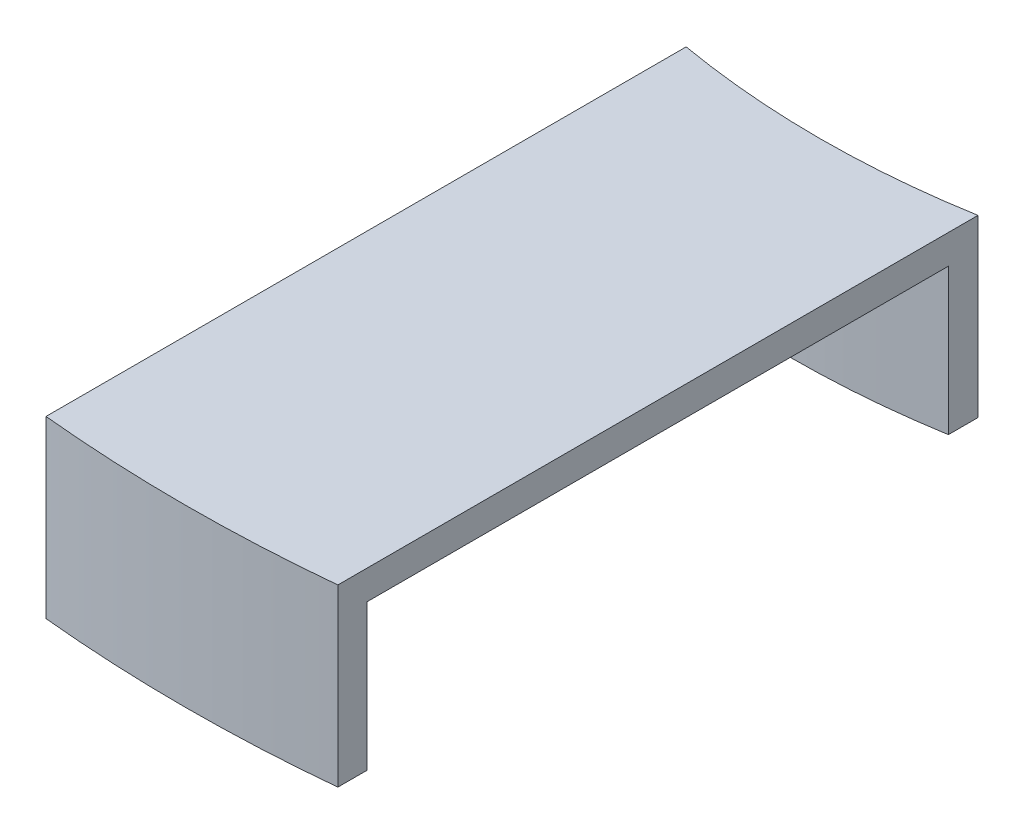
ISO-10303-21;
HEADER;
FILE_DESCRIPTION(('STEP AP214'),'2;1');
FILE_NAME('part.step','',(''),(''),'','','');
FILE_SCHEMA(('AUTOMOTIVE_DESIGN { 1 0 10303 214 1 1 1 1 }'));
ENDSEC;
DATA;
#1=APPLICATION_CONTEXT('core data for automotive mechanical design processes');
#2=APPLICATION_PROTOCOL_DEFINITION('international standard','automotive_design',2000,#1);
#3=PRODUCT_CONTEXT('',#1,'mechanical');
#4=PRODUCT('Part','Part','',(#3));
#5=PRODUCT_RELATED_PRODUCT_CATEGORY('part','',(#4));
#6=PRODUCT_DEFINITION_FORMATION('','',#4);
#7=PRODUCT_DEFINITION_CONTEXT('part definition',#1,'design');
#8=PRODUCT_DEFINITION('design','',#6,#7);
#9=PRODUCT_DEFINITION_SHAPE('','',#8);
#10=(LENGTH_UNIT() NAMED_UNIT(*) SI_UNIT(.MILLI.,.METRE.));
#11=(NAMED_UNIT(*) PLANE_ANGLE_UNIT() SI_UNIT($,.RADIAN.));
#12=(NAMED_UNIT(*) SI_UNIT($,.STERADIAN.) SOLID_ANGLE_UNIT());
#13=UNCERTAINTY_MEASURE_WITH_UNIT(LENGTH_MEASURE(1.E-05),#10,'distance_accuracy_value','');
#14=(GEOMETRIC_REPRESENTATION_CONTEXT(3) GLOBAL_UNCERTAINTY_ASSIGNED_CONTEXT((#13)) GLOBAL_UNIT_ASSIGNED_CONTEXT((#10,
#11,#12)) REPRESENTATION_CONTEXT('',''));
#15=CARTESIAN_POINT('',(0.,0.,0.));
#16=DIRECTION('',(0.,0.,1.));
#17=DIRECTION('',(1.,0.,0.));
#18=AXIS2_PLACEMENT_3D('',#15,#16,#17);
#19=CARTESIAN_POINT('',(-5.,5.,0.));
#20=DIRECTION('',(-1.,0.,0.));
#21=DIRECTION('',(0.,0.,1.));
#22=AXIS2_PLACEMENT_3D('',#19,#20,#21);
#23=PLANE('',#22);
#24=DIRECTION('',(0.,0.,-1.));
#25=VECTOR('',#24,1.);
#26=CARTESIAN_POINT('',(-5.,5.,0.));
#27=LINE('',#26,#25);
#28=CARTESIAN_POINT('',(-5.,5.,49.7875631458299));
#29=VERTEX_POINT('',#28);
#30=CARTESIAN_POINT('',(-5.,5.,29.8739654256009));
#31=VERTEX_POINT('',#30);
#32=EDGE_CURVE('E119',#29,#31,#27,.T.);
#33=ORIENTED_EDGE('',*,*,#32,.F.);
#34=DIRECTION('',(0.,-1.,0.));
#35=VECTOR('',#34,1.);
#36=CARTESIAN_POINT('',(-5.,5.,49.7875631458299));
#37=LINE('',#36,#35);
#38=CARTESIAN_POINT('',(-5.,0.,49.7875631458299));
#39=VERTEX_POINT('',#38);
#40=EDGE_CURVE('E104',#29,#39,#37,.T.);
#41=ORIENTED_EDGE('',*,*,#40,.T.);
#42=DIRECTION('',(0.,0.,-1.));
#43=VECTOR('',#42,1.);
#44=CARTESIAN_POINT('',(-5.,0.,0.));
#45=LINE('',#44,#43);
#46=CARTESIAN_POINT('',(-5.,0.,50.7924939730272));
#47=VERTEX_POINT('',#46);
#48=EDGE_CURVE('E140',#47,#39,#45,.T.);
#49=ORIENTED_EDGE('',*,*,#48,.F.);
#50=DIRECTION('',(0.,-1.,0.));
#51=VECTOR('',#50,1.);
#52=CARTESIAN_POINT('',(-5.,6.,50.7924939730272));
#53=LINE('',#52,#51);
#54=CARTESIAN_POINT('',(-5.,6.,50.7924939730272));
#55=VERTEX_POINT('',#54);
#56=EDGE_CURVE('E11',#55,#47,#53,.T.);
#57=ORIENTED_EDGE('',*,*,#56,.F.);
#58=DIRECTION('',(0.,0.,-1.));
#59=VECTOR('',#58,1.);
#60=CARTESIAN_POINT('',(-5.,6.,0.));
#61=LINE('',#60,#59);
#62=CARTESIAN_POINT('',(-5.,6.,28.859570513956));
#63=VERTEX_POINT('',#62);
#64=EDGE_CURVE('E150',#55,#63,#61,.T.);
#65=ORIENTED_EDGE('',*,*,#64,.T.);
#66=DIRECTION('',(0.,-1.,0.));
#67=VECTOR('',#66,1.);
#68=CARTESIAN_POINT('',(-5.,5.,28.859570513956));
#69=LINE('',#68,#67);
#70=CARTESIAN_POINT('',(-5.,0.,28.859570513956));
#71=VERTEX_POINT('',#70);
#72=EDGE_CURVE('E58',#63,#71,#69,.T.);
#73=ORIENTED_EDGE('',*,*,#72,.T.);
#74=CARTESIAN_POINT('',(-5.,0.,29.8739654256009));
#75=VERTEX_POINT('',#74);
#76=EDGE_CURVE('E114',#75,#71,#45,.T.);
#77=ORIENTED_EDGE('',*,*,#76,.F.);
#78=DIRECTION('',(0.,-1.,0.));
#79=VECTOR('',#78,1.);
#80=CARTESIAN_POINT('',(-5.,5.,29.8739654256009));
#81=LINE('',#80,#79);
#82=EDGE_CURVE('E126',#31,#75,#81,.T.);
#83=ORIENTED_EDGE('',*,*,#82,.F.);
#84=EDGE_LOOP('',(#33,#41,#49,#57,#65,#73,#77,#83));
#85=FACE_BOUND('',#84,.T.);
#86=ADVANCED_FACE('F33',(#85),#23,.T.);
#87=CARTESIAN_POINT('',(0.,0.,0.));
#88=DIRECTION('',(0.,1.,0.));
#89=DIRECTION('',(0.,0.,1.));
#90=AXIS2_PLACEMENT_3D('',#87,#88,#89);
#91=PLANE('',#90);
#92=CARTESIAN_POINT('',(0.,0.,0.));
#93=DIRECTION('',(0.,1.,0.));
#94=DIRECTION('',(0.,0.,1.));
#95=AXIS2_PLACEMENT_3D('',#92,#93,#94);
#96=CIRCLE('',#95,30.2895);
#97=CARTESIAN_POINT('',(5.,0.,29.8739654256009));
#98=VERTEX_POINT('',#97);
#99=EDGE_CURVE('E127',#75,#98,#96,.T.);
#100=ORIENTED_EDGE('',*,*,#99,.F.);
#101=ORIENTED_EDGE('',*,*,#76,.T.);
#102=CARTESIAN_POINT('',(0.,0.,0.));
#103=DIRECTION('',(0.,1.,0.));
#104=DIRECTION('',(0.,0.,1.));
#105=AXIS2_PLACEMENT_3D('',#102,#103,#104);
#106=CIRCLE('',#105,29.2895);
#107=CARTESIAN_POINT('',(5.,0.,28.859570513956));
#108=VERTEX_POINT('',#107);
#109=EDGE_CURVE('E145',#71,#108,#106,.T.);
#110=ORIENTED_EDGE('',*,*,#109,.T.);
#111=DIRECTION('',(0.,0.,-1.));
#112=VECTOR('',#111,1.);
#113=CARTESIAN_POINT('',(5.,0.,0.));
#114=LINE('',#113,#112);
#115=EDGE_CURVE('E146',#98,#108,#114,.T.);
#116=ORIENTED_EDGE('',*,*,#115,.F.);
#117=EDGE_LOOP('',(#100,#101,#110,#116));
#118=FACE_BOUND('',#117,.T.);
#119=ADVANCED_FACE('F179',(#118),#91,.F.);
#120=CARTESIAN_POINT('',(0.,5.,0.));
#121=DIRECTION('',(0.,-1.,0.));
#122=DIRECTION('',(0.,0.,-1.));
#123=AXIS2_PLACEMENT_3D('',#120,#121,#122);
#124=CYLINDRICAL_SURFACE('',#123,51.038);
#125=CARTESIAN_POINT('',(0.,0.,0.));
#126=DIRECTION('',(0.,1.,0.));
#127=DIRECTION('',(0.,0.,1.));
#128=AXIS2_PLACEMENT_3D('',#125,#126,#127);
#129=CIRCLE('',#128,51.038);
#130=CARTESIAN_POINT('',(5.,0.,50.7924939730272));
#131=VERTEX_POINT('',#130);
#132=EDGE_CURVE('E80',#47,#131,#129,.T.);
#133=ORIENTED_EDGE('',*,*,#132,.T.);
#134=DIRECTION('',(0.,-1.,0.));
#135=VECTOR('',#134,1.);
#136=CARTESIAN_POINT('',(5.,6.,50.7924939730272));
#137=LINE('',#136,#135);
#138=CARTESIAN_POINT('',(5.,6.,50.7924939730272));
#139=VERTEX_POINT('',#138);
#140=EDGE_CURVE('E37',#139,#131,#137,.T.);
#141=ORIENTED_EDGE('',*,*,#140,.F.);
#142=CARTESIAN_POINT('',(0.,6.,0.));
#143=DIRECTION('',(0.,1.,0.));
#144=DIRECTION('',(0.,0.,1.));
#145=AXIS2_PLACEMENT_3D('',#142,#143,#144);
#146=CIRCLE('',#145,51.038);
#147=EDGE_CURVE('E147',#55,#139,#146,.T.);
#148=ORIENTED_EDGE('',*,*,#147,.F.);
#149=ORIENTED_EDGE('',*,*,#56,.T.);
#150=EDGE_LOOP('',(#133,#141,#148,#149));
#151=FACE_BOUND('',#150,.T.);
#152=ADVANCED_FACE('F175',(#151),#124,.T.);
#153=CARTESIAN_POINT('',(5.,5.,0.));
#154=DIRECTION('',(-1.,0.,0.));
#155=DIRECTION('',(0.,0.,1.));
#156=AXIS2_PLACEMENT_3D('',#153,#154,#155);
#157=PLANE('',#156);
#158=DIRECTION('',(0.,0.,-1.));
#159=VECTOR('',#158,1.);
#160=CARTESIAN_POINT('',(5.,5.,0.));
#161=LINE('',#160,#159);
#162=CARTESIAN_POINT('',(5.,5.,49.7875631458299));
#163=VERTEX_POINT('',#162);
#164=CARTESIAN_POINT('',(5.,5.,29.8739654256009));
#165=VERTEX_POINT('',#164);
#166=EDGE_CURVE('E122',#163,#165,#161,.T.);
#167=ORIENTED_EDGE('',*,*,#166,.T.);
#168=DIRECTION('',(0.,-1.,0.));
#169=VECTOR('',#168,1.);
#170=CARTESIAN_POINT('',(5.,5.,29.8739654256009));
#171=LINE('',#170,#169);
#172=EDGE_CURVE('E136',#165,#98,#171,.T.);
#173=ORIENTED_EDGE('',*,*,#172,.T.);
#174=ORIENTED_EDGE('',*,*,#115,.T.);
#175=DIRECTION('',(0.,-1.,0.));
#176=VECTOR('',#175,1.);
#177=CARTESIAN_POINT('',(5.,6.,28.859570513956));
#178=LINE('',#177,#176);
#179=CARTESIAN_POINT('',(5.,6.,28.859570513956));
#180=VERTEX_POINT('',#179);
#181=EDGE_CURVE('E156',#180,#108,#178,.T.);
#182=ORIENTED_EDGE('',*,*,#181,.F.);
#183=DIRECTION('',(0.,0.,-1.));
#184=VECTOR('',#183,1.);
#185=CARTESIAN_POINT('',(5.,6.,0.));
#186=LINE('',#185,#184);
#187=EDGE_CURVE('E149',#139,#180,#186,.T.);
#188=ORIENTED_EDGE('',*,*,#187,.F.);
#189=ORIENTED_EDGE('',*,*,#140,.T.);
#190=CARTESIAN_POINT('',(5.,0.,49.7875631458299));
#191=VERTEX_POINT('',#190);
#192=EDGE_CURVE('E142',#131,#191,#114,.T.);
#193=ORIENTED_EDGE('',*,*,#192,.T.);
#194=DIRECTION('',(0.,-1.,0.));
#195=VECTOR('',#194,1.);
#196=CARTESIAN_POINT('',(5.,5.,49.7875631458299));
#197=LINE('',#196,#195);
#198=EDGE_CURVE('E49',#163,#191,#197,.T.);
#199=ORIENTED_EDGE('',*,*,#198,.F.);
#200=EDGE_LOOP('',(#167,#173,#174,#182,#188,#189,#193,#199));
#201=FACE_BOUND('',#200,.T.);
#202=ADVANCED_FACE('F166',(#201),#157,.F.);
#203=CARTESIAN_POINT('',(0.,5.,0.));
#204=DIRECTION('',(0.,-1.,0.));
#205=DIRECTION('',(0.,0.,-1.));
#206=AXIS2_PLACEMENT_3D('',#203,#204,#205);
#207=CYLINDRICAL_SURFACE('',#206,29.2895);
#208=ORIENTED_EDGE('',*,*,#109,.F.);
#209=ORIENTED_EDGE('',*,*,#72,.F.);
#210=CARTESIAN_POINT('',(0.,6.,0.));
#211=DIRECTION('',(0.,1.,0.));
#212=DIRECTION('',(0.,0.,1.));
#213=AXIS2_PLACEMENT_3D('',#210,#211,#212);
#214=CIRCLE('',#213,29.2895);
#215=EDGE_CURVE('E151',#63,#180,#214,.T.);
#216=ORIENTED_EDGE('',*,*,#215,.T.);
#217=ORIENTED_EDGE('',*,*,#181,.T.);
#218=EDGE_LOOP('',(#208,#209,#216,#217));
#219=FACE_BOUND('',#218,.T.);
#220=ADVANCED_FACE('F168',(#219),#207,.F.);
#221=CARTESIAN_POINT('',(0.,6.,0.));
#222=DIRECTION('',(0.,1.,0.));
#223=DIRECTION('',(0.,0.,1.));
#224=AXIS2_PLACEMENT_3D('',#221,#222,#223);
#225=PLANE('',#224);
#226=ORIENTED_EDGE('',*,*,#64,.F.);
#227=ORIENTED_EDGE('',*,*,#147,.T.);
#228=ORIENTED_EDGE('',*,*,#187,.T.);
#229=ORIENTED_EDGE('',*,*,#215,.F.);
#230=EDGE_LOOP('',(#226,#227,#228,#229));
#231=FACE_BOUND('',#230,.T.);
#232=ADVANCED_FACE('F35',(#231),#225,.T.);
#233=ORIENTED_EDGE('',*,*,#48,.T.);
#234=CARTESIAN_POINT('',(0.,0.,0.));
#235=DIRECTION('',(0.,1.,0.));
#236=DIRECTION('',(0.,0.,1.));
#237=AXIS2_PLACEMENT_3D('',#234,#235,#236);
#238=CIRCLE('',#237,50.038);
#239=EDGE_CURVE('E109',#39,#191,#238,.T.);
#240=ORIENTED_EDGE('',*,*,#239,.T.);
#241=ORIENTED_EDGE('',*,*,#192,.F.);
#242=ORIENTED_EDGE('',*,*,#132,.F.);
#243=EDGE_LOOP('',(#233,#240,#241,#242));
#244=FACE_BOUND('',#243,.T.);
#245=ADVANCED_FACE('F174',(#244),#91,.F.);
#246=CARTESIAN_POINT('',(0.,5.,0.));
#247=DIRECTION('',(0.,-1.,0.));
#248=DIRECTION('',(0.,0.,-1.));
#249=AXIS2_PLACEMENT_3D('',#246,#247,#248);
#250=CYLINDRICAL_SURFACE('',#249,50.038);
#251=ORIENTED_EDGE('',*,*,#239,.F.);
#252=ORIENTED_EDGE('',*,*,#40,.F.);
#253=CARTESIAN_POINT('',(0.,5.,0.));
#254=DIRECTION('',(0.,1.,0.));
#255=DIRECTION('',(0.,0.,1.));
#256=AXIS2_PLACEMENT_3D('',#253,#254,#255);
#257=CIRCLE('',#256,50.038);
#258=EDGE_CURVE('E107',#29,#163,#257,.T.);
#259=ORIENTED_EDGE('',*,*,#258,.T.);
#260=ORIENTED_EDGE('',*,*,#198,.T.);
#261=EDGE_LOOP('',(#251,#252,#259,#260));
#262=FACE_BOUND('',#261,.T.);
#263=ADVANCED_FACE('F106',(#262),#250,.F.);
#264=CARTESIAN_POINT('',(0.,5.,0.));
#265=DIRECTION('',(0.,-1.,0.));
#266=DIRECTION('',(0.,0.,-1.));
#267=AXIS2_PLACEMENT_3D('',#264,#265,#266);
#268=CYLINDRICAL_SURFACE('',#267,30.2895);
#269=ORIENTED_EDGE('',*,*,#99,.T.);
#270=ORIENTED_EDGE('',*,*,#172,.F.);
#271=CARTESIAN_POINT('',(0.,5.,0.));
#272=DIRECTION('',(0.,1.,0.));
#273=DIRECTION('',(0.,0.,1.));
#274=AXIS2_PLACEMENT_3D('',#271,#272,#273);
#275=CIRCLE('',#274,30.2895);
#276=EDGE_CURVE('E132',#31,#165,#275,.T.);
#277=ORIENTED_EDGE('',*,*,#276,.F.);
#278=ORIENTED_EDGE('',*,*,#82,.T.);
#279=EDGE_LOOP('',(#269,#270,#277,#278));
#280=FACE_BOUND('',#279,.T.);
#281=ADVANCED_FACE('F223',(#280),#268,.T.);
#282=CARTESIAN_POINT('',(0.,5.,0.));
#283=DIRECTION('',(0.,1.,0.));
#284=DIRECTION('',(0.,0.,1.));
#285=AXIS2_PLACEMENT_3D('',#282,#283,#284);
#286=PLANE('',#285);
#287=ORIENTED_EDGE('',*,*,#32,.T.);
#288=ORIENTED_EDGE('',*,*,#276,.T.);
#289=ORIENTED_EDGE('',*,*,#166,.F.);
#290=ORIENTED_EDGE('',*,*,#258,.F.);
#291=EDGE_LOOP('',(#287,#288,#289,#290));
#292=FACE_BOUND('',#291,.T.);
#293=ADVANCED_FACE('F117',(#292),#286,.F.);
#294=CLOSED_SHELL('',(#86,#119,#152,#202,#220,#232,#245,#263,#281,#293));
#295=MANIFOLD_SOLID_BREP('B2',#294);
#296=ADVANCED_BREP_SHAPE_REPRESENTATION('',(#18,#295),#14);
#297=SHAPE_DEFINITION_REPRESENTATION(#9,#296);
ENDSEC;
END-ISO-10303-21;
